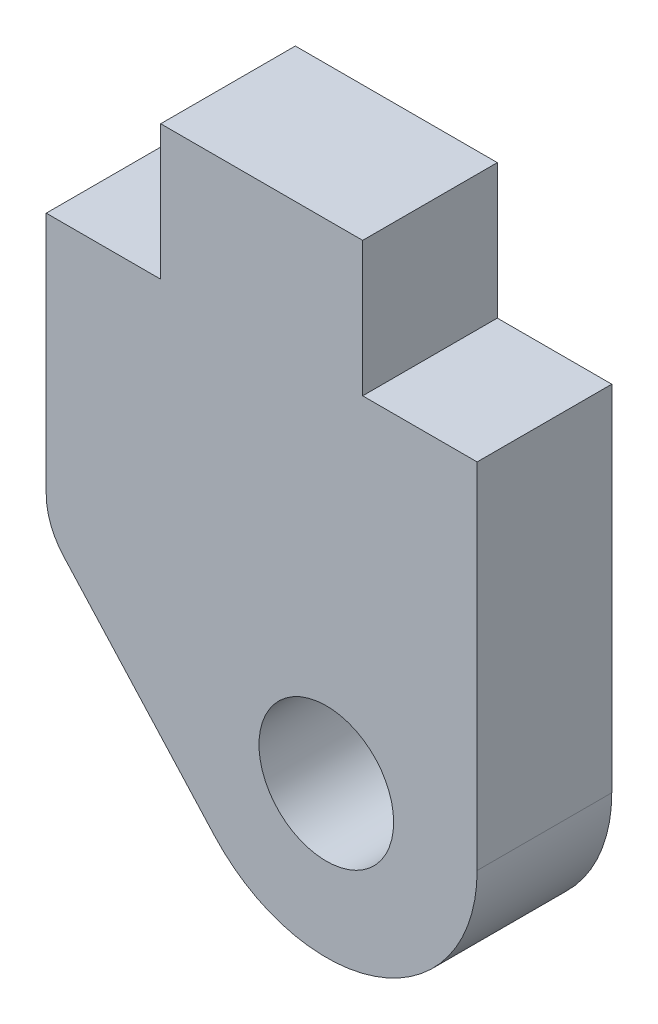
ISO-10303-21;
HEADER;
FILE_DESCRIPTION(('STEP AP214'),'2;1');
FILE_NAME('part.step','',(''),(''),'','','');
FILE_SCHEMA(('AUTOMOTIVE_DESIGN { 1 0 10303 214 1 1 1 1 }'));
ENDSEC;
DATA;
#1=APPLICATION_CONTEXT('core data for automotive mechanical design processes');
#2=APPLICATION_PROTOCOL_DEFINITION('international standard','automotive_design',2000,#1);
#3=PRODUCT_CONTEXT('',#1,'mechanical');
#4=PRODUCT('Part','Part','',(#3));
#5=PRODUCT_RELATED_PRODUCT_CATEGORY('part','',(#4));
#6=PRODUCT_DEFINITION_FORMATION('','',#4);
#7=PRODUCT_DEFINITION_CONTEXT('part definition',#1,'design');
#8=PRODUCT_DEFINITION('design','',#6,#7);
#9=PRODUCT_DEFINITION_SHAPE('','',#8);
#10=(LENGTH_UNIT() NAMED_UNIT(*) SI_UNIT(.MILLI.,.METRE.));
#11=(NAMED_UNIT(*) PLANE_ANGLE_UNIT() SI_UNIT($,.RADIAN.));
#12=(NAMED_UNIT(*) SI_UNIT($,.STERADIAN.) SOLID_ANGLE_UNIT());
#13=UNCERTAINTY_MEASURE_WITH_UNIT(LENGTH_MEASURE(1.E-05),#10,'distance_accuracy_value','');
#14=(GEOMETRIC_REPRESENTATION_CONTEXT(3) GLOBAL_UNCERTAINTY_ASSIGNED_CONTEXT((#13)) GLOBAL_UNIT_ASSIGNED_CONTEXT((#10,
#11,#12)) REPRESENTATION_CONTEXT('',''));
#15=CARTESIAN_POINT('',(0.,0.,0.));
#16=DIRECTION('',(0.,0.,1.));
#17=DIRECTION('',(1.,0.,0.));
#18=AXIS2_PLACEMENT_3D('',#15,#16,#17);
#19=CARTESIAN_POINT('',(-3.4925,-5.73790823877787,1.5875));
#20=DIRECTION('',(0.,0.,-1.));
#21=DIRECTION('',(-1.,0.,0.));
#22=AXIS2_PLACEMENT_3D('',#19,#20,#21);
#23=CYLINDRICAL_SURFACE('',#22,1.5875);
#24=CARTESIAN_POINT('',(-3.4925,-5.73790823877787,-1.5875));
#25=DIRECTION('',(0.,0.,1.));
#26=DIRECTION('',(1.,0.,0.));
#27=AXIS2_PLACEMENT_3D('',#24,#25,#26);
#28=CIRCLE('',#27,1.5875);
#29=CARTESIAN_POINT('',(-4.66908088219075,-6.80365383584278,-1.5875));
#30=VERTEX_POINT('',#29);
#31=CARTESIAN_POINT('',(-5.08,-5.73790823877787,-1.5875));
#32=VERTEX_POINT('',#31);
#33=EDGE_CURVE('E156',#30,#32,#28,.F.);
#34=ORIENTED_EDGE('',*,*,#33,.F.);
#35=DIRECTION('',(0.,0.,-1.));
#36=VECTOR('',#35,1.);
#37=CARTESIAN_POINT('',(-4.66908088219075,-6.80365383584278,1.5875));
#38=LINE('',#37,#36);
#39=CARTESIAN_POINT('',(-4.66908088219075,-6.80365383584278,1.5875));
#40=VERTEX_POINT('',#39);
#41=EDGE_CURVE('E11',#40,#30,#38,.T.);
#42=ORIENTED_EDGE('',*,*,#41,.F.);
#43=CARTESIAN_POINT('',(-3.4925,-5.73790823877787,1.5875));
#44=DIRECTION('',(0.,0.,1.));
#45=DIRECTION('',(1.,0.,0.));
#46=AXIS2_PLACEMENT_3D('',#43,#44,#45);
#47=CIRCLE('',#46,1.5875);
#48=CARTESIAN_POINT('',(-5.08,-5.73790823877787,1.5875));
#49=VERTEX_POINT('',#48);
#50=EDGE_CURVE('E196',#40,#49,#47,.F.);
#51=ORIENTED_EDGE('',*,*,#50,.T.);
#52=DIRECTION('',(0.,0.,-1.));
#53=VECTOR('',#52,1.);
#54=CARTESIAN_POINT('',(-5.08,-5.73790823877787,1.5875));
#55=LINE('',#54,#53);
#56=EDGE_CURVE('E98',#49,#32,#55,.T.);
#57=ORIENTED_EDGE('',*,*,#56,.T.);
#58=EDGE_LOOP('',(#34,#42,#51,#57));
#59=FACE_BOUND('',#58,.T.);
#60=ADVANCED_FACE('F41',(#59),#23,.T.);
#61=CARTESIAN_POINT('',(-5.95000932952428,-5.38951154265616,1.5875));
#62=DIRECTION('',(0.741153311616221,0.671335809174744,0.));
#63=DIRECTION('',(-0.671335809174744,0.741153311616221,0.));
#64=AXIS2_PLACEMENT_3D('',#61,#62,#63);
#65=PLANE('',#64);
#66=DIRECTION('',(0.671335809174744,-0.741153311616221,0.));
#67=VECTOR('',#66,1.);
#68=CARTESIAN_POINT('',(-5.95000932952428,-5.38951154265616,-1.5875));
#69=LINE('',#68,#67);
#70=CARTESIAN_POINT('',(-1.11154117610728,-10.7311701374254,-1.5875));
#71=VERTEX_POINT('',#70);
#72=EDGE_CURVE('E160',#30,#71,#69,.T.);
#73=ORIENTED_EDGE('',*,*,#72,.T.);
#74=DIRECTION('',(0.,0.,-1.));
#75=VECTOR('',#74,1.);
#76=CARTESIAN_POINT('',(-1.11154117610728,-10.7311701374254,1.5875));
#77=LINE('',#76,#75);
#78=CARTESIAN_POINT('',(-1.11154117610728,-10.7311701374254,1.5875));
#79=VERTEX_POINT('',#78);
#80=EDGE_CURVE('E50',#79,#71,#77,.T.);
#81=ORIENTED_EDGE('',*,*,#80,.F.);
#82=DIRECTION('',(0.671335809174744,-0.741153311616221,0.));
#83=VECTOR('',#82,1.);
#84=CARTESIAN_POINT('',(-5.95000932952428,-5.38951154265616,1.5875));
#85=LINE('',#84,#83);
#86=EDGE_CURVE('E238',#40,#79,#85,.T.);
#87=ORIENTED_EDGE('',*,*,#86,.F.);
#88=ORIENTED_EDGE('',*,*,#41,.T.);
#89=EDGE_LOOP('',(#73,#81,#87,#88));
#90=FACE_BOUND('',#89,.T.);
#91=ADVANCED_FACE('F224',(#90),#65,.F.);
#92=CARTESIAN_POINT('',(1.524,-8.3439,1.5875));
#93=DIRECTION('',(0.,0.,-1.));
#94=DIRECTION('',(-1.,0.,0.));
#95=AXIS2_PLACEMENT_3D('',#92,#93,#94);
#96=CYLINDRICAL_SURFACE('',#95,3.556);
#97=CARTESIAN_POINT('',(1.524,-8.3439,-1.5875));
#98=DIRECTION('',(0.,0.,1.));
#99=DIRECTION('',(1.,0.,0.));
#100=AXIS2_PLACEMENT_3D('',#97,#98,#99);
#101=CIRCLE('',#100,3.556);
#102=CARTESIAN_POINT('',(5.08,-8.3439,-1.5875));
#103=VERTEX_POINT('',#102);
#104=EDGE_CURVE('E164',#103,#71,#101,.F.);
#105=ORIENTED_EDGE('',*,*,#104,.F.);
#106=DIRECTION('',(0.,0.,-1.));
#107=VECTOR('',#106,1.);
#108=CARTESIAN_POINT('',(5.08,-8.3439,1.5875));
#109=LINE('',#108,#107);
#110=CARTESIAN_POINT('',(5.08,-8.3439,1.5875));
#111=VERTEX_POINT('',#110);
#112=EDGE_CURVE('E212',#111,#103,#109,.T.);
#113=ORIENTED_EDGE('',*,*,#112,.F.);
#114=CARTESIAN_POINT('',(1.524,-8.3439,1.5875));
#115=DIRECTION('',(0.,0.,1.));
#116=DIRECTION('',(1.,0.,0.));
#117=AXIS2_PLACEMENT_3D('',#114,#115,#116);
#118=CIRCLE('',#117,3.556);
#119=EDGE_CURVE('E221',#111,#79,#118,.F.);
#120=ORIENTED_EDGE('',*,*,#119,.T.);
#121=ORIENTED_EDGE('',*,*,#80,.T.);
#122=EDGE_LOOP('',(#105,#113,#120,#121));
#123=FACE_BOUND('',#122,.T.);
#124=ADVANCED_FACE('F219',(#123),#96,.T.);
#125=CARTESIAN_POINT('',(5.08,0.,1.5875));
#126=DIRECTION('',(1.,0.,0.));
#127=DIRECTION('',(0.,1.,0.));
#128=AXIS2_PLACEMENT_3D('',#125,#126,#127);
#129=PLANE('',#128);
#130=DIRECTION('',(0.,-1.,0.));
#131=VECTOR('',#130,1.);
#132=CARTESIAN_POINT('',(5.08,0.,-1.5875));
#133=LINE('',#132,#131);
#134=CARTESIAN_POINT('',(5.08,0.,-1.5875));
#135=VERTEX_POINT('',#134);
#136=EDGE_CURVE('E168',#135,#103,#133,.T.);
#137=ORIENTED_EDGE('',*,*,#136,.F.);
#138=DIRECTION('',(0.,0.,-1.));
#139=VECTOR('',#138,1.);
#140=CARTESIAN_POINT('',(5.08,0.,1.5875));
#141=LINE('',#140,#139);
#142=CARTESIAN_POINT('',(5.08,0.,1.5875));
#143=VERTEX_POINT('',#142);
#144=EDGE_CURVE('E209',#143,#135,#141,.T.);
#145=ORIENTED_EDGE('',*,*,#144,.F.);
#146=DIRECTION('',(0.,-1.,0.));
#147=VECTOR('',#146,1.);
#148=CARTESIAN_POINT('',(5.08,0.,1.5875));
#149=LINE('',#148,#147);
#150=EDGE_CURVE('E235',#143,#111,#149,.T.);
#151=ORIENTED_EDGE('',*,*,#150,.T.);
#152=ORIENTED_EDGE('',*,*,#112,.T.);
#153=EDGE_LOOP('',(#137,#145,#151,#152));
#154=FACE_BOUND('',#153,.T.);
#155=ADVANCED_FACE('F232',(#154),#129,.T.);
#156=CARTESIAN_POINT('',(0.,0.,1.5875));
#157=DIRECTION('',(0.,1.,0.));
#158=DIRECTION('',(-1.,0.,0.));
#159=AXIS2_PLACEMENT_3D('',#156,#157,#158);
#160=PLANE('',#159);
#161=DIRECTION('',(1.,0.,0.));
#162=VECTOR('',#161,1.);
#163=CARTESIAN_POINT('',(0.,0.,-1.5875));
#164=LINE('',#163,#162);
#165=CARTESIAN_POINT('',(2.38125,0.,-1.5875));
#166=VERTEX_POINT('',#165);
#167=EDGE_CURVE('E172',#166,#135,#164,.T.);
#168=ORIENTED_EDGE('',*,*,#167,.F.);
#169=DIRECTION('',(0.,0.,-1.));
#170=VECTOR('',#169,1.);
#171=CARTESIAN_POINT('',(2.38125,0.,1.5875));
#172=LINE('',#171,#170);
#173=CARTESIAN_POINT('',(2.38125,0.,1.5875));
#174=VERTEX_POINT('',#173);
#175=EDGE_CURVE('E206',#174,#166,#172,.T.);
#176=ORIENTED_EDGE('',*,*,#175,.F.);
#177=DIRECTION('',(1.,0.,0.));
#178=VECTOR('',#177,1.);
#179=CARTESIAN_POINT('',(0.,0.,1.5875));
#180=LINE('',#179,#178);
#181=EDGE_CURVE('E243',#174,#143,#180,.T.);
#182=ORIENTED_EDGE('',*,*,#181,.T.);
#183=ORIENTED_EDGE('',*,*,#144,.T.);
#184=EDGE_LOOP('',(#168,#176,#182,#183));
#185=FACE_BOUND('',#184,.T.);
#186=ADVANCED_FACE('F270',(#185),#160,.T.);
#187=CARTESIAN_POINT('',(2.38125,0.,1.5875));
#188=DIRECTION('',(-1.,0.,0.));
#189=DIRECTION('',(0.,0.,1.));
#190=AXIS2_PLACEMENT_3D('',#187,#188,#189);
#191=PLANE('',#190);
#192=DIRECTION('',(0.,1.,0.));
#193=VECTOR('',#192,1.);
#194=CARTESIAN_POINT('',(2.38125,0.,-1.5875));
#195=LINE('',#194,#193);
#196=CARTESIAN_POINT('',(2.38125,3.175,-1.5875));
#197=VERTEX_POINT('',#196);
#198=EDGE_CURVE('E176',#166,#197,#195,.T.);
#199=ORIENTED_EDGE('',*,*,#198,.T.);
#200=DIRECTION('',(0.,0.,-1.));
#201=VECTOR('',#200,1.);
#202=CARTESIAN_POINT('',(2.38125,3.175,1.5875));
#203=LINE('',#202,#201);
#204=CARTESIAN_POINT('',(2.38125,3.175,1.5875));
#205=VERTEX_POINT('',#204);
#206=EDGE_CURVE('E203',#205,#197,#203,.T.);
#207=ORIENTED_EDGE('',*,*,#206,.F.);
#208=DIRECTION('',(0.,1.,0.));
#209=VECTOR('',#208,1.);
#210=CARTESIAN_POINT('',(2.38125,0.,1.5875));
#211=LINE('',#210,#209);
#212=EDGE_CURVE('E250',#174,#205,#211,.T.);
#213=ORIENTED_EDGE('',*,*,#212,.F.);
#214=ORIENTED_EDGE('',*,*,#175,.T.);
#215=EDGE_LOOP('',(#199,#207,#213,#214));
#216=FACE_BOUND('',#215,.T.);
#217=ADVANCED_FACE('F273',(#216),#191,.F.);
#218=CARTESIAN_POINT('',(0.,3.175,1.5875));
#219=DIRECTION('',(0.,1.,0.));
#220=DIRECTION('',(0.,0.,1.));
#221=AXIS2_PLACEMENT_3D('',#218,#219,#220);
#222=PLANE('',#221);
#223=DIRECTION('',(1.,0.,0.));
#224=VECTOR('',#223,1.);
#225=CARTESIAN_POINT('',(0.,3.175,-1.5875));
#226=LINE('',#225,#224);
#227=CARTESIAN_POINT('',(-2.38125,3.175,-1.5875));
#228=VERTEX_POINT('',#227);
#229=EDGE_CURVE('E180',#228,#197,#226,.T.);
#230=ORIENTED_EDGE('',*,*,#229,.F.);
#231=DIRECTION('',(0.,0.,-1.));
#232=VECTOR('',#231,1.);
#233=CARTESIAN_POINT('',(-2.38125,3.175,1.5875));
#234=LINE('',#233,#232);
#235=CARTESIAN_POINT('',(-2.38125,3.175,1.5875));
#236=VERTEX_POINT('',#235);
#237=EDGE_CURVE('E135',#236,#228,#234,.T.);
#238=ORIENTED_EDGE('',*,*,#237,.F.);
#239=DIRECTION('',(1.,0.,0.));
#240=VECTOR('',#239,1.);
#241=CARTESIAN_POINT('',(0.,3.175,1.5875));
#242=LINE('',#241,#240);
#243=EDGE_CURVE('E142',#236,#205,#242,.T.);
#244=ORIENTED_EDGE('',*,*,#243,.T.);
#245=ORIENTED_EDGE('',*,*,#206,.T.);
#246=EDGE_LOOP('',(#230,#238,#244,#245));
#247=FACE_BOUND('',#246,.T.);
#248=ADVANCED_FACE('F255',(#247),#222,.T.);
#249=CARTESIAN_POINT('',(-2.38125,0.,1.5875));
#250=DIRECTION('',(-1.,0.,0.));
#251=DIRECTION('',(0.,0.,1.));
#252=AXIS2_PLACEMENT_3D('',#249,#250,#251);
#253=PLANE('',#252);
#254=DIRECTION('',(0.,1.,0.));
#255=VECTOR('',#254,1.);
#256=CARTESIAN_POINT('',(-2.38125,0.,-1.5875));
#257=LINE('',#256,#255);
#258=CARTESIAN_POINT('',(-2.38125,0.,-1.5875));
#259=VERTEX_POINT('',#258);
#260=EDGE_CURVE('E129',#259,#228,#257,.T.);
#261=ORIENTED_EDGE('',*,*,#260,.F.);
#262=DIRECTION('',(0.,0.,-1.));
#263=VECTOR('',#262,1.);
#264=CARTESIAN_POINT('',(-2.38125,0.,1.5875));
#265=LINE('',#264,#263);
#266=CARTESIAN_POINT('',(-2.38125,0.,1.5875));
#267=VERTEX_POINT('',#266);
#268=EDGE_CURVE('E124',#267,#259,#265,.T.);
#269=ORIENTED_EDGE('',*,*,#268,.F.);
#270=DIRECTION('',(0.,1.,0.));
#271=VECTOR('',#270,1.);
#272=CARTESIAN_POINT('',(-2.38125,0.,1.5875));
#273=LINE('',#272,#271);
#274=EDGE_CURVE('E127',#267,#236,#273,.T.);
#275=ORIENTED_EDGE('',*,*,#274,.T.);
#276=ORIENTED_EDGE('',*,*,#237,.T.);
#277=EDGE_LOOP('',(#261,#269,#275,#276));
#278=FACE_BOUND('',#277,.T.);
#279=ADVANCED_FACE('F126',(#278),#253,.T.);
#280=CARTESIAN_POINT('',(0.,0.,1.5875));
#281=DIRECTION('',(0.,1.,0.));
#282=DIRECTION('',(0.,0.,1.));
#283=AXIS2_PLACEMENT_3D('',#280,#281,#282);
#284=PLANE('',#283);
#285=DIRECTION('',(1.,0.,0.));
#286=VECTOR('',#285,1.);
#287=CARTESIAN_POINT('',(0.,0.,-1.5875));
#288=LINE('',#287,#286);
#289=CARTESIAN_POINT('',(-5.08,0.,-1.5875));
#290=VERTEX_POINT('',#289);
#291=EDGE_CURVE('E186',#290,#259,#288,.T.);
#292=ORIENTED_EDGE('',*,*,#291,.F.);
#293=DIRECTION('',(0.,0.,-1.));
#294=VECTOR('',#293,1.);
#295=CARTESIAN_POINT('',(-5.08,0.,1.5875));
#296=LINE('',#295,#294);
#297=CARTESIAN_POINT('',(-5.08,0.,1.5875));
#298=VERTEX_POINT('',#297);
#299=EDGE_CURVE('E91',#298,#290,#296,.T.);
#300=ORIENTED_EDGE('',*,*,#299,.F.);
#301=DIRECTION('',(1.,0.,0.));
#302=VECTOR('',#301,1.);
#303=CARTESIAN_POINT('',(0.,0.,1.5875));
#304=LINE('',#303,#302);
#305=EDGE_CURVE('E140',#298,#267,#304,.T.);
#306=ORIENTED_EDGE('',*,*,#305,.T.);
#307=ORIENTED_EDGE('',*,*,#268,.T.);
#308=EDGE_LOOP('',(#292,#300,#306,#307));
#309=FACE_BOUND('',#308,.T.);
#310=ADVANCED_FACE('F145',(#309),#284,.T.);
#311=CARTESIAN_POINT('',(-5.08,0.,1.5875));
#312=DIRECTION('',(1.,0.,0.));
#313=DIRECTION('',(0.,1.,0.));
#314=AXIS2_PLACEMENT_3D('',#311,#312,#313);
#315=PLANE('',#314);
#316=DIRECTION('',(0.,-1.,0.));
#317=VECTOR('',#316,1.);
#318=CARTESIAN_POINT('',(-5.08,0.,-1.5875));
#319=LINE('',#318,#317);
#320=EDGE_CURVE('E189',#290,#32,#319,.T.);
#321=ORIENTED_EDGE('',*,*,#320,.T.);
#322=ORIENTED_EDGE('',*,*,#56,.F.);
#323=DIRECTION('',(0.,-1.,0.));
#324=VECTOR('',#323,1.);
#325=CARTESIAN_POINT('',(-5.08,0.,1.5875));
#326=LINE('',#325,#324);
#327=EDGE_CURVE('E58',#298,#49,#326,.T.);
#328=ORIENTED_EDGE('',*,*,#327,.F.);
#329=ORIENTED_EDGE('',*,*,#299,.T.);
#330=EDGE_LOOP('',(#321,#322,#328,#329));
#331=FACE_BOUND('',#330,.T.);
#332=ADVANCED_FACE('F257',(#331),#315,.F.);
#333=CARTESIAN_POINT('',(1.524,-8.3439,1.5875));
#334=DIRECTION('',(0.,0.,-1.));
#335=DIRECTION('',(-1.,0.,0.));
#336=AXIS2_PLACEMENT_3D('',#333,#334,#335);
#337=CYLINDRICAL_SURFACE('',#336,1.5875);
#338=CARTESIAN_POINT('',(1.524,-8.3439,1.5875));
#339=DIRECTION('',(0.,0.,1.));
#340=DIRECTION('',(1.,0.,0.));
#341=AXIS2_PLACEMENT_3D('',#338,#339,#340);
#342=CIRCLE('',#341,1.5875);
#343=CARTESIAN_POINT('',(3.1115,-8.3439,1.5875));
#344=VERTEX_POINT('',#343);
#345=EDGE_CURVE('E149',#344,#344,#342,.T.);
#346=ORIENTED_EDGE('',*,*,#345,.T.);
#347=EDGE_LOOP('',(#346));
#348=FACE_BOUND('',#347,.T.);
#349=CARTESIAN_POINT('',(1.524,-8.3439,-1.5875));
#350=DIRECTION('',(0.,0.,1.));
#351=DIRECTION('',(1.,0.,0.));
#352=AXIS2_PLACEMENT_3D('',#349,#350,#351);
#353=CIRCLE('',#352,1.5875);
#354=CARTESIAN_POINT('',(3.1115,-8.3439,-1.5875));
#355=VERTEX_POINT('',#354);
#356=EDGE_CURVE('E192',#355,#355,#353,.T.);
#357=ORIENTED_EDGE('',*,*,#356,.F.);
#358=EDGE_LOOP('',(#357));
#359=FACE_BOUND('',#358,.T.);
#360=ADVANCED_FACE('F286',(#348,#359),#337,.F.);
#361=CARTESIAN_POINT('',(0.,0.,1.5875));
#362=DIRECTION('',(0.,0.,1.));
#363=DIRECTION('',(1.,0.,0.));
#364=AXIS2_PLACEMENT_3D('',#361,#362,#363);
#365=PLANE('',#364);
#366=ORIENTED_EDGE('',*,*,#50,.F.);
#367=ORIENTED_EDGE('',*,*,#86,.T.);
#368=ORIENTED_EDGE('',*,*,#119,.F.);
#369=ORIENTED_EDGE('',*,*,#150,.F.);
#370=ORIENTED_EDGE('',*,*,#181,.F.);
#371=ORIENTED_EDGE('',*,*,#212,.T.);
#372=ORIENTED_EDGE('',*,*,#243,.F.);
#373=ORIENTED_EDGE('',*,*,#274,.F.);
#374=ORIENTED_EDGE('',*,*,#305,.F.);
#375=ORIENTED_EDGE('',*,*,#327,.T.);
#376=EDGE_LOOP('',(#366,#367,#368,#369,#370,#371,#372,#373,#374,#375));
#377=FACE_BOUND('',#376,.T.);
#378=ORIENTED_EDGE('',*,*,#345,.F.);
#379=EDGE_LOOP('',(#378));
#380=FACE_BOUND('',#379,.T.);
#381=ADVANCED_FACE('F138',(#377,#380),#365,.T.);
#382=CARTESIAN_POINT('',(0.,0.,-1.5875));
#383=DIRECTION('',(0.,0.,1.));
#384=DIRECTION('',(1.,0.,0.));
#385=AXIS2_PLACEMENT_3D('',#382,#383,#384);
#386=PLANE('',#385);
#387=ORIENTED_EDGE('',*,*,#33,.T.);
#388=ORIENTED_EDGE('',*,*,#320,.F.);
#389=ORIENTED_EDGE('',*,*,#291,.T.);
#390=ORIENTED_EDGE('',*,*,#260,.T.);
#391=ORIENTED_EDGE('',*,*,#229,.T.);
#392=ORIENTED_EDGE('',*,*,#198,.F.);
#393=ORIENTED_EDGE('',*,*,#167,.T.);
#394=ORIENTED_EDGE('',*,*,#136,.T.);
#395=ORIENTED_EDGE('',*,*,#104,.T.);
#396=ORIENTED_EDGE('',*,*,#72,.F.);
#397=EDGE_LOOP('',(#387,#388,#389,#390,#391,#392,#393,#394,#395,#396));
#398=FACE_BOUND('',#397,.T.);
#399=ORIENTED_EDGE('',*,*,#356,.T.);
#400=EDGE_LOOP('',(#399));
#401=FACE_BOUND('',#400,.T.);
#402=ADVANCED_FACE('F226',(#398,#401),#386,.F.);
#403=CLOSED_SHELL('',(#60,#91,#124,#155,#186,#217,#248,#279,#310,#332,#360,#381,#402));
#404=MANIFOLD_SOLID_BREP('B2',#403);
#405=ADVANCED_BREP_SHAPE_REPRESENTATION('',(#18,#404),#14);
#406=SHAPE_DEFINITION_REPRESENTATION(#9,#405);
ENDSEC;
END-ISO-10303-21;
